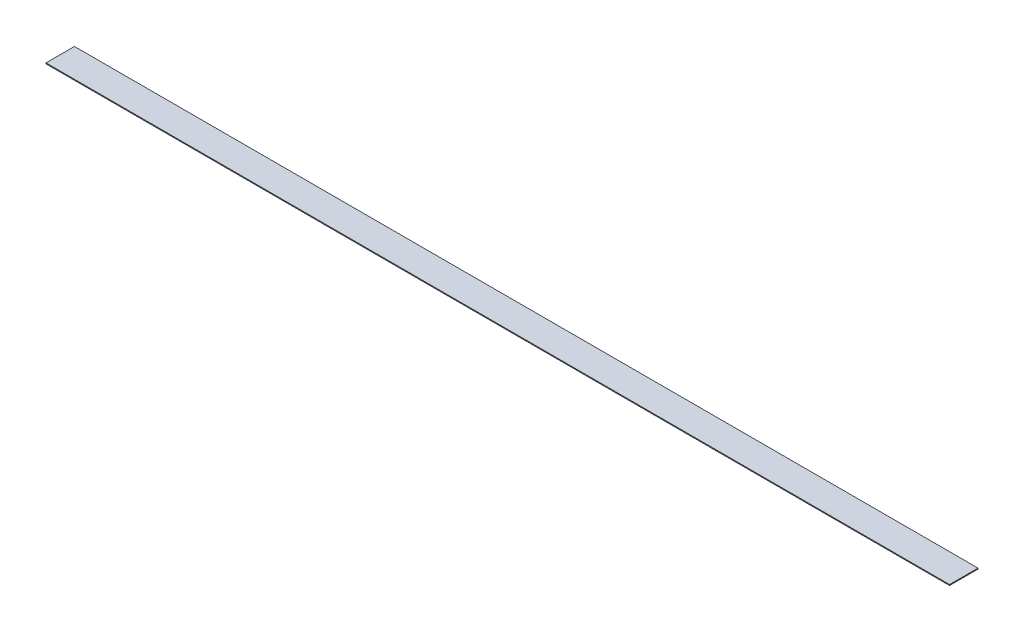
ISO-10303-21;
HEADER;
FILE_DESCRIPTION(('STEP AP214'),'2;1');
FILE_NAME('part.step','',(''),(''),'','','');
FILE_SCHEMA(('AUTOMOTIVE_DESIGN { 1 0 10303 214 1 1 1 1 }'));
ENDSEC;
DATA;
#1=APPLICATION_CONTEXT('core data for automotive mechanical design processes');
#2=APPLICATION_PROTOCOL_DEFINITION('international standard','automotive_design',2000,#1);
#3=PRODUCT_CONTEXT('',#1,'mechanical');
#4=PRODUCT('Part','Part','',(#3));
#5=PRODUCT_RELATED_PRODUCT_CATEGORY('part','',(#4));
#6=PRODUCT_DEFINITION_FORMATION('','',#4);
#7=PRODUCT_DEFINITION_CONTEXT('part definition',#1,'design');
#8=PRODUCT_DEFINITION('design','',#6,#7);
#9=PRODUCT_DEFINITION_SHAPE('','',#8);
#10=(LENGTH_UNIT() NAMED_UNIT(*) SI_UNIT(.MILLI.,.METRE.));
#11=(NAMED_UNIT(*) PLANE_ANGLE_UNIT() SI_UNIT($,.RADIAN.));
#12=(NAMED_UNIT(*) SI_UNIT($,.STERADIAN.) SOLID_ANGLE_UNIT());
#13=UNCERTAINTY_MEASURE_WITH_UNIT(LENGTH_MEASURE(1.E-05),#10,'distance_accuracy_value','');
#14=(GEOMETRIC_REPRESENTATION_CONTEXT(3) GLOBAL_UNCERTAINTY_ASSIGNED_CONTEXT((#13)) GLOBAL_UNIT_ASSIGNED_CONTEXT((#10,
#11,#12)) REPRESENTATION_CONTEXT('',''));
#15=CARTESIAN_POINT('',(0.,0.,0.));
#16=DIRECTION('',(0.,0.,1.));
#17=DIRECTION('',(1.,0.,0.));
#18=AXIS2_PLACEMENT_3D('',#15,#16,#17);
#19=CARTESIAN_POINT('',(0.,1.5875,0.));
#20=DIRECTION('',(1.,0.,0.));
#21=DIRECTION('',(0.,0.,-1.));
#22=AXIS2_PLACEMENT_3D('',#19,#20,#21);
#23=PLANE('',#22);
#24=DIRECTION('',(0.,0.,1.));
#25=VECTOR('',#24,1.);
#26=CARTESIAN_POINT('',(0.,0.,0.));
#27=LINE('',#26,#25);
#28=CARTESIAN_POINT('',(0.,0.,-50.8));
#29=VERTEX_POINT('',#28);
#30=CARTESIAN_POINT('',(0.,0.,0.));
#31=VERTEX_POINT('',#30);
#32=EDGE_CURVE('E98',#29,#31,#27,.T.);
#33=ORIENTED_EDGE('',*,*,#32,.T.);
#34=DIRECTION('',(0.,-1.,0.));
#35=VECTOR('',#34,1.);
#36=CARTESIAN_POINT('',(0.,1.5875,0.));
#37=LINE('',#36,#35);
#38=CARTESIAN_POINT('',(0.,1.5875,0.));
#39=VERTEX_POINT('',#38);
#40=EDGE_CURVE('E11',#39,#31,#37,.T.);
#41=ORIENTED_EDGE('',*,*,#40,.F.);
#42=DIRECTION('',(0.,0.,1.));
#43=VECTOR('',#42,1.);
#44=CARTESIAN_POINT('',(0.,1.5875,0.));
#45=LINE('',#44,#43);
#46=CARTESIAN_POINT('',(0.,1.5875,-50.8));
#47=VERTEX_POINT('',#46);
#48=EDGE_CURVE('E86',#47,#39,#45,.T.);
#49=ORIENTED_EDGE('',*,*,#48,.F.);
#50=DIRECTION('',(0.,-1.,0.));
#51=VECTOR('',#50,1.);
#52=CARTESIAN_POINT('',(0.,1.5875,-50.8));
#53=LINE('',#52,#51);
#54=EDGE_CURVE('E94',#47,#29,#53,.T.);
#55=ORIENTED_EDGE('',*,*,#54,.T.);
#56=EDGE_LOOP('',(#33,#41,#49,#55));
#57=FACE_BOUND('',#56,.T.);
#58=ADVANCED_FACE('F35',(#57),#23,.F.);
#59=CARTESIAN_POINT('',(0.,1.5875,0.));
#60=DIRECTION('',(0.,0.,-1.));
#61=DIRECTION('',(-1.,0.,0.));
#62=AXIS2_PLACEMENT_3D('',#59,#60,#61);
#63=PLANE('',#62);
#64=DIRECTION('',(1.,0.,0.));
#65=VECTOR('',#64,1.);
#66=CARTESIAN_POINT('',(0.,0.,0.));
#67=LINE('',#66,#65);
#68=CARTESIAN_POINT('',(1612.9,0.,0.));
#69=VERTEX_POINT('',#68);
#70=EDGE_CURVE('E90',#31,#69,#67,.T.);
#71=ORIENTED_EDGE('',*,*,#70,.T.);
#72=DIRECTION('',(0.,-1.,0.));
#73=VECTOR('',#72,1.);
#74=CARTESIAN_POINT('',(1612.9,1.5875,0.));
#75=LINE('',#74,#73);
#76=CARTESIAN_POINT('',(1612.9,1.5875,0.));
#77=VERTEX_POINT('',#76);
#78=EDGE_CURVE('E43',#77,#69,#75,.T.);
#79=ORIENTED_EDGE('',*,*,#78,.F.);
#80=DIRECTION('',(1.,0.,0.));
#81=VECTOR('',#80,1.);
#82=CARTESIAN_POINT('',(0.,1.5875,0.));
#83=LINE('',#82,#81);
#84=EDGE_CURVE('E81',#39,#77,#83,.T.);
#85=ORIENTED_EDGE('',*,*,#84,.F.);
#86=ORIENTED_EDGE('',*,*,#40,.T.);
#87=EDGE_LOOP('',(#71,#79,#85,#86));
#88=FACE_BOUND('',#87,.T.);
#89=ADVANCED_FACE('F89',(#88),#63,.F.);
#90=CARTESIAN_POINT('',(1612.9,1.5875,0.));
#91=DIRECTION('',(-1.,0.,0.));
#92=DIRECTION('',(0.,0.,1.));
#93=AXIS2_PLACEMENT_3D('',#90,#91,#92);
#94=PLANE('',#93);
#95=DIRECTION('',(0.,0.,-1.));
#96=VECTOR('',#95,1.);
#97=CARTESIAN_POINT('',(1612.9,0.,0.));
#98=LINE('',#97,#96);
#99=CARTESIAN_POINT('',(1612.9,0.,-50.8));
#100=VERTEX_POINT('',#99);
#101=EDGE_CURVE('E68',#69,#100,#98,.T.);
#102=ORIENTED_EDGE('',*,*,#101,.T.);
#103=DIRECTION('',(0.,-1.,0.));
#104=VECTOR('',#103,1.);
#105=CARTESIAN_POINT('',(1612.9,1.5875,-50.8));
#106=LINE('',#105,#104);
#107=CARTESIAN_POINT('',(1612.9,1.5875,-50.8));
#108=VERTEX_POINT('',#107);
#109=EDGE_CURVE('E91',#108,#100,#106,.T.);
#110=ORIENTED_EDGE('',*,*,#109,.F.);
#111=DIRECTION('',(0.,0.,-1.));
#112=VECTOR('',#111,1.);
#113=CARTESIAN_POINT('',(1612.9,1.5875,0.));
#114=LINE('',#113,#112);
#115=EDGE_CURVE('E84',#77,#108,#114,.T.);
#116=ORIENTED_EDGE('',*,*,#115,.F.);
#117=ORIENTED_EDGE('',*,*,#78,.T.);
#118=EDGE_LOOP('',(#102,#110,#116,#117));
#119=FACE_BOUND('',#118,.T.);
#120=ADVANCED_FACE('F92',(#119),#94,.F.);
#121=CARTESIAN_POINT('',(0.,1.5875,-50.8));
#122=DIRECTION('',(0.,0.,1.));
#123=DIRECTION('',(1.,0.,0.));
#124=AXIS2_PLACEMENT_3D('',#121,#122,#123);
#125=PLANE('',#124);
#126=DIRECTION('',(-1.,0.,0.));
#127=VECTOR('',#126,1.);
#128=CARTESIAN_POINT('',(0.,0.,-50.8));
#129=LINE('',#128,#127);
#130=EDGE_CURVE('E74',#100,#29,#129,.T.);
#131=ORIENTED_EDGE('',*,*,#130,.T.);
#132=ORIENTED_EDGE('',*,*,#54,.F.);
#133=DIRECTION('',(-1.,0.,0.));
#134=VECTOR('',#133,1.);
#135=CARTESIAN_POINT('',(0.,1.5875,-50.8));
#136=LINE('',#135,#134);
#137=EDGE_CURVE('E51',#108,#47,#136,.T.);
#138=ORIENTED_EDGE('',*,*,#137,.F.);
#139=ORIENTED_EDGE('',*,*,#109,.T.);
#140=EDGE_LOOP('',(#131,#132,#138,#139));
#141=FACE_BOUND('',#140,.T.);
#142=ADVANCED_FACE('F105',(#141),#125,.F.);
#143=CARTESIAN_POINT('',(0.,1.5875,0.));
#144=DIRECTION('',(0.,-1.,0.));
#145=DIRECTION('',(0.,0.,-1.));
#146=AXIS2_PLACEMENT_3D('',#143,#144,#145);
#147=PLANE('',#146);
#148=ORIENTED_EDGE('',*,*,#48,.T.);
#149=ORIENTED_EDGE('',*,*,#84,.T.);
#150=ORIENTED_EDGE('',*,*,#115,.T.);
#151=ORIENTED_EDGE('',*,*,#137,.T.);
#152=EDGE_LOOP('',(#148,#149,#150,#151));
#153=FACE_BOUND('',#152,.T.);
#154=ADVANCED_FACE('F82',(#153),#147,.F.);
#155=CARTESIAN_POINT('',(0.,0.,0.));
#156=DIRECTION('',(0.,-1.,0.));
#157=DIRECTION('',(0.,0.,-1.));
#158=AXIS2_PLACEMENT_3D('',#155,#156,#157);
#159=PLANE('',#158);
#160=ORIENTED_EDGE('',*,*,#32,.F.);
#161=ORIENTED_EDGE('',*,*,#130,.F.);
#162=ORIENTED_EDGE('',*,*,#101,.F.);
#163=ORIENTED_EDGE('',*,*,#70,.F.);
#164=EDGE_LOOP('',(#160,#161,#162,#163));
#165=FACE_BOUND('',#164,.T.);
#166=ADVANCED_FACE('F108',(#165),#159,.T.);
#167=CLOSED_SHELL('',(#58,#89,#120,#142,#154,#166));
#168=MANIFOLD_SOLID_BREP('B2',#167);
#169=ADVANCED_BREP_SHAPE_REPRESENTATION('',(#18,#168),#14);
#170=SHAPE_DEFINITION_REPRESENTATION(#9,#169);
ENDSEC;
END-ISO-10303-21;
